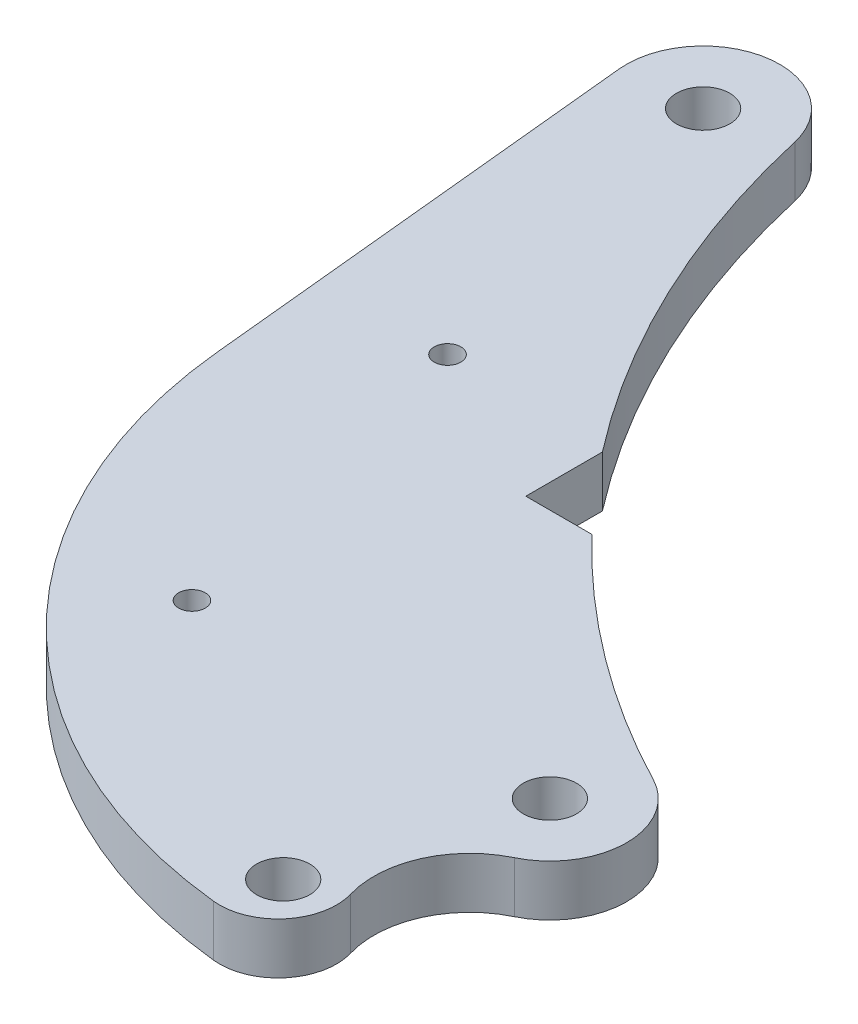
ISO-10303-21;
HEADER;
FILE_DESCRIPTION(('STEP AP214'),'2;1');
FILE_NAME('part.step','',(''),(''),'','','');
FILE_SCHEMA(('AUTOMOTIVE_DESIGN { 1 0 10303 214 1 1 1 1 }'));
ENDSEC;
DATA;
#1=APPLICATION_CONTEXT('core data for automotive mechanical design processes');
#2=APPLICATION_PROTOCOL_DEFINITION('international standard','automotive_design',2000,#1);
#3=PRODUCT_CONTEXT('',#1,'mechanical');
#4=PRODUCT('Part','Part','',(#3));
#5=PRODUCT_RELATED_PRODUCT_CATEGORY('part','',(#4));
#6=PRODUCT_DEFINITION_FORMATION('','',#4);
#7=PRODUCT_DEFINITION_CONTEXT('part definition',#1,'design');
#8=PRODUCT_DEFINITION('design','',#6,#7);
#9=PRODUCT_DEFINITION_SHAPE('','',#8);
#10=(LENGTH_UNIT() NAMED_UNIT(*) SI_UNIT(.MILLI.,.METRE.));
#11=(NAMED_UNIT(*) PLANE_ANGLE_UNIT() SI_UNIT($,.RADIAN.));
#12=(NAMED_UNIT(*) SI_UNIT($,.STERADIAN.) SOLID_ANGLE_UNIT());
#13=UNCERTAINTY_MEASURE_WITH_UNIT(LENGTH_MEASURE(1.E-05),#10,'distance_accuracy_value','');
#14=(GEOMETRIC_REPRESENTATION_CONTEXT(3) GLOBAL_UNCERTAINTY_ASSIGNED_CONTEXT((#13)) GLOBAL_UNIT_ASSIGNED_CONTEXT((#10,
#11,#12)) REPRESENTATION_CONTEXT('',''));
#15=CARTESIAN_POINT('',(0.,0.,0.));
#16=DIRECTION('',(0.,0.,1.));
#17=DIRECTION('',(1.,0.,0.));
#18=AXIS2_PLACEMENT_3D('',#15,#16,#17);
#19=CARTESIAN_POINT('',(0.,3.048,0.));
#20=DIRECTION('',(0.,1.,0.));
#21=DIRECTION('',(0.,0.,1.));
#22=AXIS2_PLACEMENT_3D('',#19,#20,#21);
#23=PLANE('',#22);
#24=CARTESIAN_POINT('',(10.16,3.048,40.64));
#25=DIRECTION('',(0.,1.,0.));
#26=DIRECTION('',(0.,0.,1.));
#27=AXIS2_PLACEMENT_3D('',#24,#25,#26);
#28=CIRCLE('',#27,1.5875);
#29=CARTESIAN_POINT('',(10.16,3.048,42.2275));
#30=VERTEX_POINT('',#29);
#31=EDGE_CURVE('E224',#30,#30,#28,.T.);
#32=ORIENTED_EDGE('',*,*,#31,.F.);
#33=EDGE_LOOP('',(#32));
#34=FACE_BOUND('',#33,.T.);
#35=CARTESIAN_POINT('',(62.1230111231787,3.048,80.394598630688));
#36=DIRECTION('',(0.,1.,0.));
#37=DIRECTION('',(0.,0.,1.));
#38=AXIS2_PLACEMENT_3D('',#35,#36,#37);
#39=CIRCLE('',#38,3.175);
#40=CARTESIAN_POINT('',(62.1230111231787,3.048,83.569598630688));
#41=VERTEX_POINT('',#40);
#42=EDGE_CURVE('E212',#41,#41,#39,.T.);
#43=ORIENTED_EDGE('',*,*,#42,.F.);
#44=EDGE_LOOP('',(#43));
#45=FACE_BOUND('',#44,.T.);
#46=CARTESIAN_POINT('',(0.,3.048,0.));
#47=DIRECTION('',(0.,1.,0.));
#48=DIRECTION('',(0.,0.,1.));
#49=AXIS2_PLACEMENT_3D('',#46,#47,#48);
#50=CIRCLE('',#49,9.14400000000001);
#51=CARTESIAN_POINT('',(8.91502982381273,3.048,-2.03346483631509));
#52=VERTEX_POINT('',#51);
#53=CARTESIAN_POINT('',(-9.09923524379032,3.048,0.903689093750812));
#54=VERTEX_POINT('',#53);
#55=EDGE_CURVE('E161',#52,#54,#50,.T.);
#56=ORIENTED_EDGE('',*,*,#55,.T.);
#57=DIRECTION('',(0.0988286410488635,0.,0.995104466731224));
#58=VECTOR('',#57,1.);
#59=CARTESIAN_POINT('',(-9.09923524379032,3.048,0.903689093750812));
#60=LINE('',#59,#58);
#61=CARTESIAN_POINT('',(-3.80757133563289,3.048,54.1853930164458));
#62=VERTEX_POINT('',#61);
#63=EDGE_CURVE('E99',#54,#62,#60,.T.);
#64=ORIENTED_EDGE('',*,*,#63,.T.);
#65=CARTESIAN_POINT('',(59.3815623017999,3.048,47.9097743098429));
#66=DIRECTION('',(0.,1.,0.));
#67=DIRECTION('',(0.,0.,-1.));
#68=AXIS2_PLACEMENT_3D('',#65,#66,#67);
#69=CIRCLE('',#68,63.5);
#70=CARTESIAN_POINT('',(52.6784219206597,3.048,111.054987184856));
#71=VERTEX_POINT('',#70);
#72=EDGE_CURVE('E182',#62,#71,#69,.T.);
#73=ORIENTED_EDGE('',*,*,#72,.T.);
#74=CARTESIAN_POINT('',(53.4157673625851,3.048,104.109013768605));
#75=DIRECTION('',(0.,1.,0.));
#76=DIRECTION('',(0.,0.,1.));
#77=AXIS2_PLACEMENT_3D('',#74,#75,#76);
#78=CIRCLE('',#77,6.985);
#79=CARTESIAN_POINT('',(60.1171702292743,3.048,102.138880621243));
#80=VERTEX_POINT('',#79);
#81=EDGE_CURVE('E201',#71,#80,#78,.T.);
#82=ORIENTED_EDGE('',*,*,#81,.T.);
#83=CARTESIAN_POINT('',(71.0831021929474,3.048,98.9150263801071));
#84=DIRECTION('',(0.,-1.,0.));
#85=DIRECTION('',(0.,0.,-1.));
#86=AXIS2_PLACEMENT_3D('',#83,#84,#85);
#87=CIRCLE('',#86,11.43);
#88=CARTESIAN_POINT('',(66.1052738208537,3.048,88.6258998526521));
#89=VERTEX_POINT('',#88);
#90=EDGE_CURVE('E198',#80,#89,#87,.T.);
#91=ORIENTED_EDGE('',*,*,#90,.T.);
#92=CARTESIAN_POINT('',(62.1230111231787,3.048,80.394598630688));
#93=DIRECTION('',(0.,1.,0.));
#94=DIRECTION('',(0.,0.,1.));
#95=AXIS2_PLACEMENT_3D('',#92,#93,#94);
#96=CIRCLE('',#95,9.144);
#97=CARTESIAN_POINT('',(66.3396619544821,3.048,72.2808700323882));
#98=VERTEX_POINT('',#97);
#99=EDGE_CURVE('E200',#89,#98,#96,.T.);
#100=ORIENTED_EDGE('',*,*,#99,.T.);
#101=CARTESIAN_POINT('',(117.876505448191,3.048,-26.8869239468317));
#102=DIRECTION('',(0.,-1.,0.));
#103=DIRECTION('',(0.,0.,1.));
#104=AXIS2_PLACEMENT_3D('',#101,#102,#103);
#105=CIRCLE('',#104,111.76);
#106=CARTESIAN_POINT('',(37.3478982086017,3.048,50.6078566261337));
#107=VERTEX_POINT('',#106);
#108=EDGE_CURVE('E124',#98,#107,#105,.T.);
#109=ORIENTED_EDGE('',*,*,#108,.T.);
#110=DIRECTION('',(-1.,0.,0.));
#111=VECTOR('',#110,1.);
#112=CARTESIAN_POINT('',(29.464,3.048,50.6078566261337));
#113=LINE('',#112,#111);
#114=CARTESIAN_POINT('',(29.464,3.048,50.6078566261337));
#115=VERTEX_POINT('',#114);
#116=EDGE_CURVE('E118',#107,#115,#113,.T.);
#117=ORIENTED_EDGE('',*,*,#116,.T.);
#118=DIRECTION('',(0.,0.,-1.));
#119=VECTOR('',#118,1.);
#120=CARTESIAN_POINT('',(29.464,3.048,41.4762714171482));
#121=LINE('',#120,#119);
#122=CARTESIAN_POINT('',(29.464,3.048,41.4762714171481));
#123=VERTEX_POINT('',#122);
#124=EDGE_CURVE('E122',#115,#123,#121,.T.);
#125=ORIENTED_EDGE('',*,*,#124,.T.);
#126=CARTESIAN_POINT('',(117.876505448191,3.048,-26.8869239468317));
#127=DIRECTION('',(0.,-1.,0.));
#128=DIRECTION('',(0.,0.,1.));
#129=AXIS2_PLACEMENT_3D('',#126,#127,#128);
#130=CIRCLE('',#129,111.76);
#131=EDGE_CURVE('E50',#123,#52,#130,.T.);
#132=ORIENTED_EDGE('',*,*,#131,.T.);
#133=EDGE_LOOP('',(#56,#64,#73,#82,#91,#100,#109,#117,#125,#132));
#134=FACE_BOUND('',#133,.T.);
#135=CARTESIAN_POINT('',(0.,3.048,0.));
#136=DIRECTION('',(0.,1.,0.));
#137=DIRECTION('',(0.,0.,1.));
#138=AXIS2_PLACEMENT_3D('',#135,#136,#137);
#139=CIRCLE('',#138,3.175);
#140=CARTESIAN_POINT('',(0.,3.048,3.175));
#141=VERTEX_POINT('',#140);
#142=EDGE_CURVE('E146',#141,#141,#139,.T.);
#143=ORIENTED_EDGE('',*,*,#142,.F.);
#144=EDGE_LOOP('',(#143));
#145=FACE_BOUND('',#144,.T.);
#146=CARTESIAN_POINT('',(54.5672350025058,3.048,104.644758366539));
#147=DIRECTION('',(0.,1.,0.));
#148=DIRECTION('',(0.,0.,1.));
#149=AXIS2_PLACEMENT_3D('',#146,#147,#148);
#150=CIRCLE('',#149,3.175);
#151=CARTESIAN_POINT('',(54.5672350025058,3.048,107.819758366539));
#152=VERTEX_POINT('',#151);
#153=EDGE_CURVE('E218',#152,#152,#150,.T.);
#154=ORIENTED_EDGE('',*,*,#153,.F.);
#155=EDGE_LOOP('',(#154));
#156=FACE_BOUND('',#155,.T.);
#157=CARTESIAN_POINT('',(20.32,3.048,81.28));
#158=DIRECTION('',(0.,1.,0.));
#159=DIRECTION('',(0.,0.,1.));
#160=AXIS2_PLACEMENT_3D('',#157,#158,#159);
#161=CIRCLE('',#160,1.58750000000001);
#162=CARTESIAN_POINT('',(20.32,3.048,82.8675));
#163=VERTEX_POINT('',#162);
#164=EDGE_CURVE('E230',#163,#163,#161,.T.);
#165=ORIENTED_EDGE('',*,*,#164,.F.);
#166=EDGE_LOOP('',(#165));
#167=FACE_BOUND('',#166,.T.);
#168=ADVANCED_FACE('F33',(#34,#45,#134,#145,#156,#167),#23,.T.);
#169=CARTESIAN_POINT('',(0.,-3.048,0.));
#170=DIRECTION('',(0.,1.,0.));
#171=DIRECTION('',(0.,0.,1.));
#172=AXIS2_PLACEMENT_3D('',#169,#170,#171);
#173=PLANE('',#172);
#174=CARTESIAN_POINT('',(0.,-3.048,0.));
#175=DIRECTION('',(0.,1.,0.));
#176=DIRECTION('',(0.,0.,1.));
#177=AXIS2_PLACEMENT_3D('',#174,#175,#176);
#178=CIRCLE('',#177,9.14400000000001);
#179=CARTESIAN_POINT('',(8.91502982381273,-3.048,-2.03346483631509));
#180=VERTEX_POINT('',#179);
#181=CARTESIAN_POINT('',(-9.09923524379032,-3.048,0.903689093750812));
#182=VERTEX_POINT('',#181);
#183=EDGE_CURVE('E142',#180,#182,#178,.T.);
#184=ORIENTED_EDGE('',*,*,#183,.F.);
#185=CARTESIAN_POINT('',(117.876505448191,-3.048,-26.8869239468317));
#186=DIRECTION('',(0.,-1.,0.));
#187=DIRECTION('',(0.,0.,1.));
#188=AXIS2_PLACEMENT_3D('',#185,#186,#187);
#189=CIRCLE('',#188,111.76);
#190=CARTESIAN_POINT('',(29.464,-3.048,41.4762714171481));
#191=VERTEX_POINT('',#190);
#192=EDGE_CURVE('E91',#191,#180,#189,.T.);
#193=ORIENTED_EDGE('',*,*,#192,.F.);
#194=DIRECTION('',(0.,0.,-1.));
#195=VECTOR('',#194,1.);
#196=CARTESIAN_POINT('',(29.464,-3.048,41.4762714171482));
#197=LINE('',#196,#195);
#198=CARTESIAN_POINT('',(29.464,-3.048,50.6078566261337));
#199=VERTEX_POINT('',#198);
#200=EDGE_CURVE('E85',#199,#191,#197,.T.);
#201=ORIENTED_EDGE('',*,*,#200,.F.);
#202=DIRECTION('',(-1.,0.,0.));
#203=VECTOR('',#202,1.);
#204=CARTESIAN_POINT('',(29.464,-3.048,50.6078566261337));
#205=LINE('',#204,#203);
#206=CARTESIAN_POINT('',(37.3478982086017,-3.048,50.6078566261337));
#207=VERTEX_POINT('',#206);
#208=EDGE_CURVE('E132',#207,#199,#205,.T.);
#209=ORIENTED_EDGE('',*,*,#208,.F.);
#210=CARTESIAN_POINT('',(117.876505448191,-3.048,-26.8869239468317));
#211=DIRECTION('',(0.,-1.,0.));
#212=DIRECTION('',(0.,0.,1.));
#213=AXIS2_PLACEMENT_3D('',#210,#211,#212);
#214=CIRCLE('',#213,111.76);
#215=CARTESIAN_POINT('',(66.3396619544821,-3.048,72.2808700323882));
#216=VERTEX_POINT('',#215);
#217=EDGE_CURVE('E156',#216,#207,#214,.T.);
#218=ORIENTED_EDGE('',*,*,#217,.F.);
#219=CARTESIAN_POINT('',(62.1230111231787,-3.048,80.394598630688));
#220=DIRECTION('',(0.,1.,0.));
#221=DIRECTION('',(0.,0.,1.));
#222=AXIS2_PLACEMENT_3D('',#219,#220,#221);
#223=CIRCLE('',#222,9.144);
#224=CARTESIAN_POINT('',(66.1052738208537,-3.048,88.6258998526521));
#225=VERTEX_POINT('',#224);
#226=EDGE_CURVE('E154',#225,#216,#223,.T.);
#227=ORIENTED_EDGE('',*,*,#226,.F.);
#228=CARTESIAN_POINT('',(71.0831021929474,-3.048,98.9150263801071));
#229=DIRECTION('',(0.,-1.,0.));
#230=DIRECTION('',(0.,0.,-1.));
#231=AXIS2_PLACEMENT_3D('',#228,#229,#230);
#232=CIRCLE('',#231,11.43);
#233=CARTESIAN_POINT('',(60.1171702292743,-3.048,102.138880621243));
#234=VERTEX_POINT('',#233);
#235=EDGE_CURVE('E152',#234,#225,#232,.T.);
#236=ORIENTED_EDGE('',*,*,#235,.F.);
#237=CARTESIAN_POINT('',(53.4157673625851,-3.048,104.109013768605));
#238=DIRECTION('',(0.,1.,0.));
#239=DIRECTION('',(0.,0.,1.));
#240=AXIS2_PLACEMENT_3D('',#237,#238,#239);
#241=CIRCLE('',#240,6.985);
#242=CARTESIAN_POINT('',(52.6784219206597,-3.048,111.054987184856));
#243=VERTEX_POINT('',#242);
#244=EDGE_CURVE('E150',#243,#234,#241,.T.);
#245=ORIENTED_EDGE('',*,*,#244,.F.);
#246=CARTESIAN_POINT('',(59.3815623017999,-3.048,47.9097743098429));
#247=DIRECTION('',(0.,1.,0.));
#248=DIRECTION('',(0.,0.,-1.));
#249=AXIS2_PLACEMENT_3D('',#246,#247,#248);
#250=CIRCLE('',#249,63.5);
#251=CARTESIAN_POINT('',(-3.80757133563289,-3.048,54.1853930164458));
#252=VERTEX_POINT('',#251);
#253=EDGE_CURVE('E148',#252,#243,#250,.T.);
#254=ORIENTED_EDGE('',*,*,#253,.F.);
#255=DIRECTION('',(0.0988286410488635,0.,0.995104466731224));
#256=VECTOR('',#255,1.);
#257=CARTESIAN_POINT('',(-9.09923524379032,-3.048,0.903689093750812));
#258=LINE('',#257,#256);
#259=EDGE_CURVE('E145',#182,#252,#258,.T.);
#260=ORIENTED_EDGE('',*,*,#259,.F.);
#261=EDGE_LOOP('',(#184,#193,#201,#209,#218,#227,#236,#245,#254,#260));
#262=FACE_BOUND('',#261,.T.);
#263=CARTESIAN_POINT('',(0.,-3.048,0.));
#264=DIRECTION('',(0.,1.,0.));
#265=DIRECTION('',(0.,0.,1.));
#266=AXIS2_PLACEMENT_3D('',#263,#264,#265);
#267=CIRCLE('',#266,3.175);
#268=CARTESIAN_POINT('',(0.,-3.048,3.175));
#269=VERTEX_POINT('',#268);
#270=EDGE_CURVE('E209',#269,#269,#267,.T.);
#271=ORIENTED_EDGE('',*,*,#270,.T.);
#272=EDGE_LOOP('',(#271));
#273=FACE_BOUND('',#272,.T.);
#274=CARTESIAN_POINT('',(62.1230111231787,-3.048,80.394598630688));
#275=DIRECTION('',(0.,1.,0.));
#276=DIRECTION('',(0.,0.,1.));
#277=AXIS2_PLACEMENT_3D('',#274,#275,#276);
#278=CIRCLE('',#277,3.175);
#279=CARTESIAN_POINT('',(62.1230111231787,-3.048,83.569598630688));
#280=VERTEX_POINT('',#279);
#281=EDGE_CURVE('E215',#280,#280,#278,.T.);
#282=ORIENTED_EDGE('',*,*,#281,.T.);
#283=EDGE_LOOP('',(#282));
#284=FACE_BOUND('',#283,.T.);
#285=CARTESIAN_POINT('',(54.5672350025058,-3.048,104.644758366539));
#286=DIRECTION('',(0.,1.,0.));
#287=DIRECTION('',(0.,0.,1.));
#288=AXIS2_PLACEMENT_3D('',#285,#286,#287);
#289=CIRCLE('',#288,3.175);
#290=CARTESIAN_POINT('',(54.5672350025058,-3.048,107.819758366539));
#291=VERTEX_POINT('',#290);
#292=EDGE_CURVE('E221',#291,#291,#289,.T.);
#293=ORIENTED_EDGE('',*,*,#292,.T.);
#294=EDGE_LOOP('',(#293));
#295=FACE_BOUND('',#294,.T.);
#296=CARTESIAN_POINT('',(10.16,-3.048,40.64));
#297=DIRECTION('',(0.,1.,0.));
#298=DIRECTION('',(0.,0.,1.));
#299=AXIS2_PLACEMENT_3D('',#296,#297,#298);
#300=CIRCLE('',#299,1.5875);
#301=CARTESIAN_POINT('',(10.16,-3.048,42.2275));
#302=VERTEX_POINT('',#301);
#303=EDGE_CURVE('E227',#302,#302,#300,.T.);
#304=ORIENTED_EDGE('',*,*,#303,.T.);
#305=EDGE_LOOP('',(#304));
#306=FACE_BOUND('',#305,.T.);
#307=CARTESIAN_POINT('',(20.32,-3.048,81.28));
#308=DIRECTION('',(0.,1.,0.));
#309=DIRECTION('',(0.,0.,1.));
#310=AXIS2_PLACEMENT_3D('',#307,#308,#309);
#311=CIRCLE('',#310,1.58750000000001);
#312=CARTESIAN_POINT('',(20.32,-3.048,82.8675));
#313=VERTEX_POINT('',#312);
#314=EDGE_CURVE('E233',#313,#313,#311,.T.);
#315=ORIENTED_EDGE('',*,*,#314,.T.);
#316=EDGE_LOOP('',(#315));
#317=FACE_BOUND('',#316,.T.);
#318=ADVANCED_FACE('F186',(#262,#273,#284,#295,#306,#317),#173,.F.);
#319=CARTESIAN_POINT('',(0.,3.048,0.));
#320=DIRECTION('',(0.,-1.,0.));
#321=DIRECTION('',(0.,0.,-1.));
#322=AXIS2_PLACEMENT_3D('',#319,#320,#321);
#323=CYLINDRICAL_SURFACE('',#322,9.14400000000001);
#324=ORIENTED_EDGE('',*,*,#183,.T.);
#325=DIRECTION('',(0.,-1.,0.));
#326=VECTOR('',#325,1.);
#327=CARTESIAN_POINT('',(-9.09923524379032,3.048,0.903689093750812));
#328=LINE('',#327,#326);
#329=EDGE_CURVE('E11',#54,#182,#328,.T.);
#330=ORIENTED_EDGE('',*,*,#329,.F.);
#331=ORIENTED_EDGE('',*,*,#55,.F.);
#332=DIRECTION('',(0.,-1.,0.));
#333=VECTOR('',#332,1.);
#334=CARTESIAN_POINT('',(8.91502982381273,3.048,-2.03346483631509));
#335=LINE('',#334,#333);
#336=EDGE_CURVE('E138',#52,#180,#335,.T.);
#337=ORIENTED_EDGE('',*,*,#336,.T.);
#338=EDGE_LOOP('',(#324,#330,#331,#337));
#339=FACE_BOUND('',#338,.T.);
#340=ADVANCED_FACE('F35',(#339),#323,.T.);
#341=CARTESIAN_POINT('',(-9.09923524379032,3.048,0.903689093750812));
#342=DIRECTION('',(0.995104466731225,0.,-0.0988286410488635));
#343=DIRECTION('',(-0.0988286410488635,0.,-0.995104466731225));
#344=AXIS2_PLACEMENT_3D('',#341,#342,#343);
#345=PLANE('',#344);
#346=ORIENTED_EDGE('',*,*,#259,.T.);
#347=DIRECTION('',(0.,-1.,0.));
#348=VECTOR('',#347,1.);
#349=CARTESIAN_POINT('',(-3.80757133563289,3.048,54.1853930164458));
#350=LINE('',#349,#348);
#351=EDGE_CURVE('E42',#62,#252,#350,.T.);
#352=ORIENTED_EDGE('',*,*,#351,.F.);
#353=ORIENTED_EDGE('',*,*,#63,.F.);
#354=ORIENTED_EDGE('',*,*,#329,.T.);
#355=EDGE_LOOP('',(#346,#352,#353,#354));
#356=FACE_BOUND('',#355,.T.);
#357=ADVANCED_FACE('F275',(#356),#345,.F.);
#358=CARTESIAN_POINT('',(59.3815623017999,3.048,47.9097743098429));
#359=DIRECTION('',(0.,-1.,0.));
#360=DIRECTION('',(0.,0.,-1.));
#361=AXIS2_PLACEMENT_3D('',#358,#359,#360);
#362=CYLINDRICAL_SURFACE('',#361,63.5);
#363=ORIENTED_EDGE('',*,*,#253,.T.);
#364=DIRECTION('',(0.,-1.,0.));
#365=VECTOR('',#364,1.);
#366=CARTESIAN_POINT('',(52.6784219206597,3.048,111.054987184856));
#367=LINE('',#366,#365);
#368=EDGE_CURVE('E174',#71,#243,#367,.T.);
#369=ORIENTED_EDGE('',*,*,#368,.F.);
#370=ORIENTED_EDGE('',*,*,#72,.F.);
#371=ORIENTED_EDGE('',*,*,#351,.T.);
#372=EDGE_LOOP('',(#363,#369,#370,#371));
#373=FACE_BOUND('',#372,.T.);
#374=ADVANCED_FACE('F180',(#373),#362,.T.);
#375=CARTESIAN_POINT('',(53.4157673625851,3.048,104.109013768605));
#376=DIRECTION('',(0.,-1.,0.));
#377=DIRECTION('',(0.,0.,-1.));
#378=AXIS2_PLACEMENT_3D('',#375,#376,#377);
#379=CYLINDRICAL_SURFACE('',#378,6.985);
#380=ORIENTED_EDGE('',*,*,#244,.T.);
#381=DIRECTION('',(0.,-1.,0.));
#382=VECTOR('',#381,1.);
#383=CARTESIAN_POINT('',(60.1171702292743,3.048,102.138880621243));
#384=LINE('',#383,#382);
#385=EDGE_CURVE('E171',#80,#234,#384,.T.);
#386=ORIENTED_EDGE('',*,*,#385,.F.);
#387=ORIENTED_EDGE('',*,*,#81,.F.);
#388=ORIENTED_EDGE('',*,*,#368,.T.);
#389=EDGE_LOOP('',(#380,#386,#387,#388));
#390=FACE_BOUND('',#389,.T.);
#391=ADVANCED_FACE('F192',(#390),#379,.T.);
#392=CARTESIAN_POINT('',(71.0831021929474,3.048,98.9150263801071));
#393=DIRECTION('',(0.,-1.,0.));
#394=DIRECTION('',(0.,0.,-1.));
#395=AXIS2_PLACEMENT_3D('',#392,#393,#394);
#396=CYLINDRICAL_SURFACE('',#395,11.43);
#397=ORIENTED_EDGE('',*,*,#235,.T.);
#398=DIRECTION('',(0.,-1.,0.));
#399=VECTOR('',#398,1.);
#400=CARTESIAN_POINT('',(66.1052738208537,3.048,88.6258998526521));
#401=LINE('',#400,#399);
#402=EDGE_CURVE('E168',#89,#225,#401,.T.);
#403=ORIENTED_EDGE('',*,*,#402,.F.);
#404=ORIENTED_EDGE('',*,*,#90,.F.);
#405=ORIENTED_EDGE('',*,*,#385,.T.);
#406=EDGE_LOOP('',(#397,#403,#404,#405));
#407=FACE_BOUND('',#406,.T.);
#408=ADVANCED_FACE('F196',(#407),#396,.F.);
#409=CARTESIAN_POINT('',(62.1230111231787,3.048,80.394598630688));
#410=DIRECTION('',(0.,-1.,0.));
#411=DIRECTION('',(0.,0.,-1.));
#412=AXIS2_PLACEMENT_3D('',#409,#410,#411);
#413=CYLINDRICAL_SURFACE('',#412,9.144);
#414=ORIENTED_EDGE('',*,*,#226,.T.);
#415=DIRECTION('',(0.,-1.,0.));
#416=VECTOR('',#415,1.);
#417=CARTESIAN_POINT('',(66.3396619544821,3.048,72.2808700323882));
#418=LINE('',#417,#416);
#419=EDGE_CURVE('E165',#98,#216,#418,.T.);
#420=ORIENTED_EDGE('',*,*,#419,.F.);
#421=ORIENTED_EDGE('',*,*,#99,.F.);
#422=ORIENTED_EDGE('',*,*,#402,.T.);
#423=EDGE_LOOP('',(#414,#420,#421,#422));
#424=FACE_BOUND('',#423,.T.);
#425=ADVANCED_FACE('F265',(#424),#413,.T.);
#426=CARTESIAN_POINT('',(117.876505448191,3.048,-26.8869239468317));
#427=DIRECTION('',(0.,-1.,0.));
#428=DIRECTION('',(0.,0.,-1.));
#429=AXIS2_PLACEMENT_3D('',#426,#427,#428);
#430=CYLINDRICAL_SURFACE('',#429,111.76);
#431=ORIENTED_EDGE('',*,*,#217,.T.);
#432=DIRECTION('',(0.,-1.,0.));
#433=VECTOR('',#432,1.);
#434=CARTESIAN_POINT('',(37.3478982086017,3.048,50.6078566261337));
#435=LINE('',#434,#433);
#436=EDGE_CURVE('E133',#107,#207,#435,.T.);
#437=ORIENTED_EDGE('',*,*,#436,.F.);
#438=ORIENTED_EDGE('',*,*,#108,.F.);
#439=ORIENTED_EDGE('',*,*,#419,.T.);
#440=EDGE_LOOP('',(#431,#437,#438,#439));
#441=FACE_BOUND('',#440,.T.);
#442=ADVANCED_FACE('F262',(#441),#430,.F.);
#443=CARTESIAN_POINT('',(29.464,3.048,50.6078566261337));
#444=DIRECTION('',(0.,0.,1.));
#445=DIRECTION('',(1.,0.,0.));
#446=AXIS2_PLACEMENT_3D('',#443,#444,#445);
#447=PLANE('',#446);
#448=ORIENTED_EDGE('',*,*,#208,.T.);
#449=DIRECTION('',(0.,-1.,0.));
#450=VECTOR('',#449,1.);
#451=CARTESIAN_POINT('',(29.464,3.048,50.6078566261337));
#452=LINE('',#451,#450);
#453=EDGE_CURVE('E129',#115,#199,#452,.T.);
#454=ORIENTED_EDGE('',*,*,#453,.F.);
#455=ORIENTED_EDGE('',*,*,#116,.F.);
#456=ORIENTED_EDGE('',*,*,#436,.T.);
#457=EDGE_LOOP('',(#448,#454,#455,#456));
#458=FACE_BOUND('',#457,.T.);
#459=ADVANCED_FACE('F130',(#458),#447,.F.);
#460=CARTESIAN_POINT('',(29.464,3.048,41.4762714171482));
#461=DIRECTION('',(-1.,0.,0.));
#462=DIRECTION('',(0.,0.,1.));
#463=AXIS2_PLACEMENT_3D('',#460,#461,#462);
#464=PLANE('',#463);
#465=ORIENTED_EDGE('',*,*,#200,.T.);
#466=DIRECTION('',(0.,-1.,0.));
#467=VECTOR('',#466,1.);
#468=CARTESIAN_POINT('',(29.464,3.048,41.4762714171481));
#469=LINE('',#468,#467);
#470=EDGE_CURVE('E134',#123,#191,#469,.T.);
#471=ORIENTED_EDGE('',*,*,#470,.F.);
#472=ORIENTED_EDGE('',*,*,#124,.F.);
#473=ORIENTED_EDGE('',*,*,#453,.T.);
#474=EDGE_LOOP('',(#465,#471,#472,#473));
#475=FACE_BOUND('',#474,.T.);
#476=ADVANCED_FACE('F136',(#475),#464,.F.);
#477=CARTESIAN_POINT('',(117.876505448191,3.048,-26.8869239468317));
#478=DIRECTION('',(0.,-1.,0.));
#479=DIRECTION('',(0.,0.,-1.));
#480=AXIS2_PLACEMENT_3D('',#477,#478,#479);
#481=CYLINDRICAL_SURFACE('',#480,111.76);
#482=ORIENTED_EDGE('',*,*,#192,.T.);
#483=ORIENTED_EDGE('',*,*,#336,.F.);
#484=ORIENTED_EDGE('',*,*,#131,.F.);
#485=ORIENTED_EDGE('',*,*,#470,.T.);
#486=EDGE_LOOP('',(#482,#483,#484,#485));
#487=FACE_BOUND('',#486,.T.);
#488=ADVANCED_FACE('F255',(#487),#481,.F.);
#489=CARTESIAN_POINT('',(0.,3.048,0.));
#490=DIRECTION('',(0.,-1.,0.));
#491=DIRECTION('',(0.,0.,-1.));
#492=AXIS2_PLACEMENT_3D('',#489,#490,#491);
#493=CYLINDRICAL_SURFACE('',#492,3.175);
#494=ORIENTED_EDGE('',*,*,#142,.T.);
#495=EDGE_LOOP('',(#494));
#496=FACE_BOUND('',#495,.T.);
#497=ORIENTED_EDGE('',*,*,#270,.F.);
#498=EDGE_LOOP('',(#497));
#499=FACE_BOUND('',#498,.T.);
#500=ADVANCED_FACE('F252',(#496,#499),#493,.F.);
#501=CARTESIAN_POINT('',(62.1230111231787,3.048,80.394598630688));
#502=DIRECTION('',(0.,-1.,0.));
#503=DIRECTION('',(0.,0.,-1.));
#504=AXIS2_PLACEMENT_3D('',#501,#502,#503);
#505=CYLINDRICAL_SURFACE('',#504,3.175);
#506=ORIENTED_EDGE('',*,*,#42,.T.);
#507=EDGE_LOOP('',(#506));
#508=FACE_BOUND('',#507,.T.);
#509=ORIENTED_EDGE('',*,*,#281,.F.);
#510=EDGE_LOOP('',(#509));
#511=FACE_BOUND('',#510,.T.);
#512=ADVANCED_FACE('F351',(#508,#511),#505,.F.);
#513=CARTESIAN_POINT('',(54.5672350025058,3.048,104.644758366539));
#514=DIRECTION('',(0.,-1.,0.));
#515=DIRECTION('',(0.,0.,-1.));
#516=AXIS2_PLACEMENT_3D('',#513,#514,#515);
#517=CYLINDRICAL_SURFACE('',#516,3.175);
#518=ORIENTED_EDGE('',*,*,#153,.T.);
#519=EDGE_LOOP('',(#518));
#520=FACE_BOUND('',#519,.T.);
#521=ORIENTED_EDGE('',*,*,#292,.F.);
#522=EDGE_LOOP('',(#521));
#523=FACE_BOUND('',#522,.T.);
#524=ADVANCED_FACE('F359',(#520,#523),#517,.F.);
#525=CARTESIAN_POINT('',(10.16,3.048,40.64));
#526=DIRECTION('',(0.,-1.,0.));
#527=DIRECTION('',(0.,0.,-1.));
#528=AXIS2_PLACEMENT_3D('',#525,#526,#527);
#529=CYLINDRICAL_SURFACE('',#528,1.5875);
#530=ORIENTED_EDGE('',*,*,#31,.T.);
#531=EDGE_LOOP('',(#530));
#532=FACE_BOUND('',#531,.T.);
#533=ORIENTED_EDGE('',*,*,#303,.F.);
#534=EDGE_LOOP('',(#533));
#535=FACE_BOUND('',#534,.T.);
#536=ADVANCED_FACE('F367',(#532,#535),#529,.F.);
#537=CARTESIAN_POINT('',(20.32,3.048,81.28));
#538=DIRECTION('',(0.,-1.,0.));
#539=DIRECTION('',(0.,0.,-1.));
#540=AXIS2_PLACEMENT_3D('',#537,#538,#539);
#541=CYLINDRICAL_SURFACE('',#540,1.58750000000001);
#542=ORIENTED_EDGE('',*,*,#164,.T.);
#543=EDGE_LOOP('',(#542));
#544=FACE_BOUND('',#543,.T.);
#545=ORIENTED_EDGE('',*,*,#314,.F.);
#546=EDGE_LOOP('',(#545));
#547=FACE_BOUND('',#546,.T.);
#548=ADVANCED_FACE('F239',(#544,#547),#541,.F.);
#549=CLOSED_SHELL('',(#168,#318,#340,#357,#374,#391,#408,#425,#442,#459,#476,#488,#500,#512,
#524,#536,#548));
#550=MANIFOLD_SOLID_BREP('B2',#549);
#551=ADVANCED_BREP_SHAPE_REPRESENTATION('',(#18,#550),#14);
#552=SHAPE_DEFINITION_REPRESENTATION(#9,#551);
ENDSEC;
END-ISO-10303-21;
